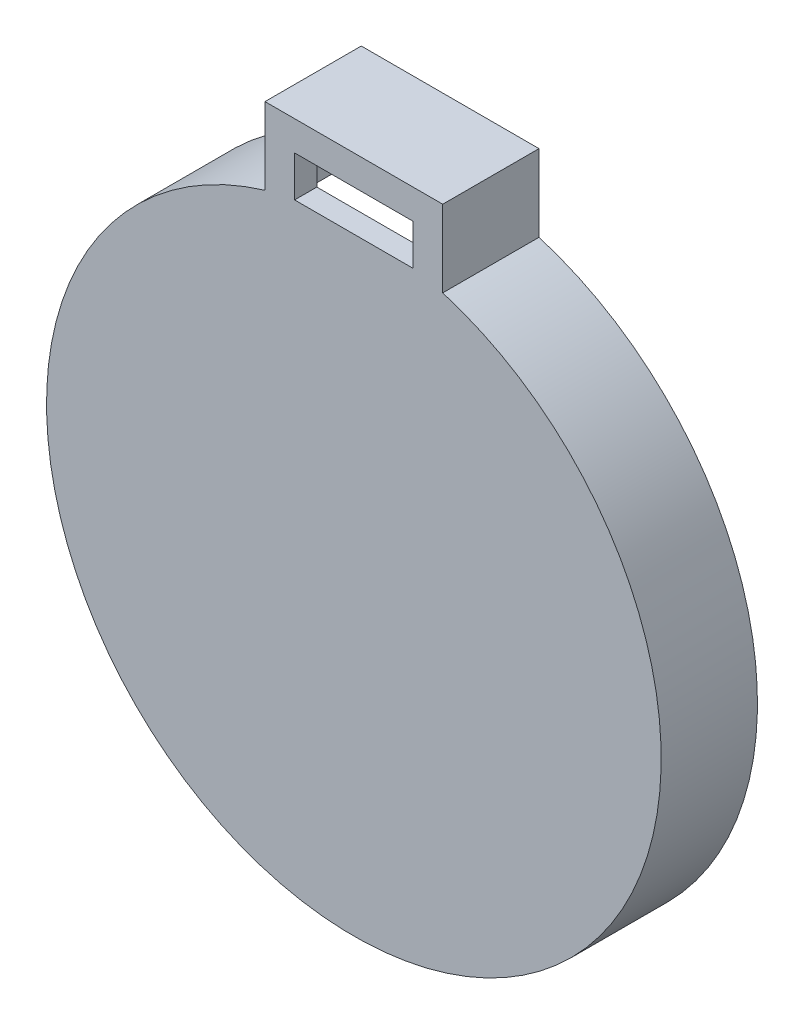
ISO-10303-21;
HEADER;
FILE_DESCRIPTION(('STEP AP214'),'2;1');
FILE_NAME('part.step','',(''),(''),'','','');
FILE_SCHEMA(('AUTOMOTIVE_DESIGN { 1 0 10303 214 1 1 1 1 }'));
ENDSEC;
DATA;
#1=APPLICATION_CONTEXT('core data for automotive mechanical design processes');
#2=APPLICATION_PROTOCOL_DEFINITION('international standard','automotive_design',2000,#1);
#3=PRODUCT_CONTEXT('',#1,'mechanical');
#4=PRODUCT('Part','Part','',(#3));
#5=PRODUCT_RELATED_PRODUCT_CATEGORY('part','',(#4));
#6=PRODUCT_DEFINITION_FORMATION('','',#4);
#7=PRODUCT_DEFINITION_CONTEXT('part definition',#1,'design');
#8=PRODUCT_DEFINITION('design','',#6,#7);
#9=PRODUCT_DEFINITION_SHAPE('','',#8);
#10=(LENGTH_UNIT() NAMED_UNIT(*) SI_UNIT(.MILLI.,.METRE.));
#11=(NAMED_UNIT(*) PLANE_ANGLE_UNIT() SI_UNIT($,.RADIAN.));
#12=(NAMED_UNIT(*) SI_UNIT($,.STERADIAN.) SOLID_ANGLE_UNIT());
#13=UNCERTAINTY_MEASURE_WITH_UNIT(LENGTH_MEASURE(1.E-05),#10,'distance_accuracy_value','');
#14=(GEOMETRIC_REPRESENTATION_CONTEXT(3) GLOBAL_UNCERTAINTY_ASSIGNED_CONTEXT((#13)) GLOBAL_UNIT_ASSIGNED_CONTEXT((#10,
#11,#12)) REPRESENTATION_CONTEXT('',''));
#15=CARTESIAN_POINT('',(0.,0.,0.));
#16=DIRECTION('',(0.,0.,1.));
#17=DIRECTION('',(1.,0.,0.));
#18=AXIS2_PLACEMENT_3D('',#15,#16,#17);
#19=CARTESIAN_POINT('',(0.,0.,-3.));
#20=DIRECTION('',(0.,0.,1.));
#21=DIRECTION('',(1.,0.,0.));
#22=AXIS2_PLACEMENT_3D('',#19,#20,#21);
#23=PLANE('',#22);
#24=DIRECTION('',(0.,-1.,0.));
#25=VECTOR('',#24,1.);
#26=CARTESIAN_POINT('',(-10.4999999999999,0.,-3.));
#27=LINE('',#26,#25);
#28=CARTESIAN_POINT('',(-10.5,48.5972796968906,-3.));
#29=VERTEX_POINT('',#28);
#30=CARTESIAN_POINT('',(-10.5,38.5972796968906,-3.));
#31=VERTEX_POINT('',#30);
#32=EDGE_CURVE('E163',#29,#31,#27,.T.);
#33=ORIENTED_EDGE('',*,*,#32,.F.);
#34=DIRECTION('',(1.,0.,0.));
#35=VECTOR('',#34,1.);
#36=CARTESIAN_POINT('',(0.,48.5972796968906,-3.));
#37=LINE('',#36,#35);
#38=CARTESIAN_POINT('',(10.5,48.5972796968906,-3.));
#39=VERTEX_POINT('',#38);
#40=EDGE_CURVE('E172',#29,#39,#37,.T.);
#41=ORIENTED_EDGE('',*,*,#40,.T.);
#42=DIRECTION('',(0.,-1.,0.));
#43=VECTOR('',#42,1.);
#44=CARTESIAN_POINT('',(10.5000000000001,0.,-3.));
#45=LINE('',#44,#43);
#46=CARTESIAN_POINT('',(10.5,38.5972796968906,-3.));
#47=VERTEX_POINT('',#46);
#48=EDGE_CURVE('E169',#39,#47,#45,.T.);
#49=ORIENTED_EDGE('',*,*,#48,.T.);
#50=CARTESIAN_POINT('',(0.,0.,-3.));
#51=DIRECTION('',(0.,0.,1.));
#52=DIRECTION('',(1.,0.,0.));
#53=AXIS2_PLACEMENT_3D('',#50,#51,#52);
#54=CIRCLE('',#53,40.);
#55=EDGE_CURVE('E166',#31,#47,#54,.T.);
#56=ORIENTED_EDGE('',*,*,#55,.F.);
#57=EDGE_LOOP('',(#33,#41,#49,#56));
#58=FACE_BOUND('',#57,.T.);
#59=DIRECTION('',(1.,0.,0.));
#60=VECTOR('',#59,1.);
#61=CARTESIAN_POINT('',(0.,46.0972796968903,-3.));
#62=LINE('',#61,#60);
#63=CARTESIAN_POINT('',(-8.,46.0972796968903,-3.));
#64=VERTEX_POINT('',#63);
#65=CARTESIAN_POINT('',(8.,46.0972796968903,-3.));
#66=VERTEX_POINT('',#65);
#67=EDGE_CURVE('E133',#64,#66,#62,.T.);
#68=ORIENTED_EDGE('',*,*,#67,.F.);
#69=DIRECTION('',(0.,-1.,0.));
#70=VECTOR('',#69,1.);
#71=CARTESIAN_POINT('',(-8.,0.,-3.));
#72=LINE('',#71,#70);
#73=CARTESIAN_POINT('',(-8.,40.5972796968903,-3.));
#74=VERTEX_POINT('',#73);
#75=EDGE_CURVE('E167',#64,#74,#72,.T.);
#76=ORIENTED_EDGE('',*,*,#75,.T.);
#77=DIRECTION('',(1.,0.,0.));
#78=VECTOR('',#77,1.);
#79=CARTESIAN_POINT('',(0.,40.5972796968903,-3.));
#80=LINE('',#79,#78);
#81=CARTESIAN_POINT('',(8.,40.5972796968903,-3.));
#82=VERTEX_POINT('',#81);
#83=EDGE_CURVE('E159',#74,#82,#80,.T.);
#84=ORIENTED_EDGE('',*,*,#83,.T.);
#85=DIRECTION('',(0.,-1.,0.));
#86=VECTOR('',#85,1.);
#87=CARTESIAN_POINT('',(8.,0.,-3.));
#88=LINE('',#87,#86);
#89=EDGE_CURVE('E162',#66,#82,#88,.T.);
#90=ORIENTED_EDGE('',*,*,#89,.F.);
#91=EDGE_LOOP('',(#68,#76,#84,#90));
#92=FACE_BOUND('',#91,.T.);
#93=ADVANCED_FACE('F40',(#58,#92),#23,.F.);
#94=CARTESIAN_POINT('',(0.,0.,0.));
#95=DIRECTION('',(0.,0.,1.));
#96=DIRECTION('',(1.,0.,0.));
#97=AXIS2_PLACEMENT_3D('',#94,#95,#96);
#98=PLANE('',#97);
#99=CARTESIAN_POINT('',(0.,0.,0.));
#100=DIRECTION('',(0.,0.,1.));
#101=DIRECTION('',(1.,0.,0.));
#102=AXIS2_PLACEMENT_3D('',#99,#100,#101);
#103=CIRCLE('',#102,41.5);
#104=CARTESIAN_POINT('',(-12.,39.7271947159625,0.));
#105=VERTEX_POINT('',#104);
#106=CARTESIAN_POINT('',(12.,39.7271947159625,0.));
#107=VERTEX_POINT('',#106);
#108=EDGE_CURVE('E175',#105,#107,#103,.T.);
#109=ORIENTED_EDGE('',*,*,#108,.T.);
#110=DIRECTION('',(0.,-1.,0.));
#111=VECTOR('',#110,1.);
#112=CARTESIAN_POINT('',(12.0000000000001,0.,0.));
#113=LINE('',#112,#111);
#114=CARTESIAN_POINT('',(12.,50.0972796968906,0.));
#115=VERTEX_POINT('',#114);
#116=EDGE_CURVE('E200',#115,#107,#113,.T.);
#117=ORIENTED_EDGE('',*,*,#116,.F.);
#118=DIRECTION('',(1.,0.,0.));
#119=VECTOR('',#118,1.);
#120=CARTESIAN_POINT('',(0.,50.0972796968906,0.));
#121=LINE('',#120,#119);
#122=CARTESIAN_POINT('',(-12.,50.0972796968906,0.));
#123=VERTEX_POINT('',#122);
#124=EDGE_CURVE('E203',#123,#115,#121,.T.);
#125=ORIENTED_EDGE('',*,*,#124,.F.);
#126=DIRECTION('',(0.,-1.,0.));
#127=VECTOR('',#126,1.);
#128=CARTESIAN_POINT('',(-11.9999999999999,0.,0.));
#129=LINE('',#128,#127);
#130=EDGE_CURVE('E180',#123,#105,#129,.T.);
#131=ORIENTED_EDGE('',*,*,#130,.T.);
#132=EDGE_LOOP('',(#109,#117,#125,#131));
#133=FACE_BOUND('',#132,.T.);
#134=DIRECTION('',(0.,1.,0.));
#135=VECTOR('',#134,1.);
#136=CARTESIAN_POINT('',(8.,0.,0.));
#137=LINE('',#136,#135);
#138=CARTESIAN_POINT('',(8.,40.5972796968903,0.));
#139=VERTEX_POINT('',#138);
#140=CARTESIAN_POINT('',(8.,46.0972796968903,0.));
#141=VERTEX_POINT('',#140);
#142=EDGE_CURVE('E140',#139,#141,#137,.T.);
#143=ORIENTED_EDGE('',*,*,#142,.F.);
#144=DIRECTION('',(-1.,0.,0.));
#145=VECTOR('',#144,1.);
#146=CARTESIAN_POINT('',(0.,40.5972796968903,0.));
#147=LINE('',#146,#145);
#148=CARTESIAN_POINT('',(-8.,40.5972796968903,0.));
#149=VERTEX_POINT('',#148);
#150=EDGE_CURVE('E146',#139,#149,#147,.T.);
#151=ORIENTED_EDGE('',*,*,#150,.T.);
#152=DIRECTION('',(0.,1.,0.));
#153=VECTOR('',#152,1.);
#154=CARTESIAN_POINT('',(-8.,0.,0.));
#155=LINE('',#154,#153);
#156=CARTESIAN_POINT('',(-8.,46.0972796968903,0.));
#157=VERTEX_POINT('',#156);
#158=EDGE_CURVE('E150',#149,#157,#155,.T.);
#159=ORIENTED_EDGE('',*,*,#158,.T.);
#160=DIRECTION('',(-1.,0.,0.));
#161=VECTOR('',#160,1.);
#162=CARTESIAN_POINT('',(0.,46.0972796968903,0.));
#163=LINE('',#162,#161);
#164=EDGE_CURVE('E65',#141,#157,#163,.T.);
#165=ORIENTED_EDGE('',*,*,#164,.F.);
#166=EDGE_LOOP('',(#143,#151,#159,#165));
#167=FACE_BOUND('',#166,.T.);
#168=ADVANCED_FACE('F149',(#133,#167),#98,.T.);
#169=CARTESIAN_POINT('',(10.5000000000001,0.,-13.));
#170=DIRECTION('',(-1.,0.,0.));
#171=DIRECTION('',(0.,-1.,0.));
#172=AXIS2_PLACEMENT_3D('',#169,#170,#171);
#173=PLANE('',#172);
#174=DIRECTION('',(0.,0.,1.));
#175=VECTOR('',#174,1.);
#176=CARTESIAN_POINT('',(10.5,38.5972796968906,-13.));
#177=LINE('',#176,#175);
#178=CARTESIAN_POINT('',(10.5,38.5972796968906,-13.));
#179=VERTEX_POINT('',#178);
#180=EDGE_CURVE('E44',#179,#47,#177,.T.);
#181=ORIENTED_EDGE('',*,*,#180,.T.);
#182=ORIENTED_EDGE('',*,*,#48,.F.);
#183=DIRECTION('',(0.,0.,1.));
#184=VECTOR('',#183,1.);
#185=CARTESIAN_POINT('',(10.5,48.5972796968906,-13.));
#186=LINE('',#185,#184);
#187=CARTESIAN_POINT('',(10.5,48.5972796968906,-13.));
#188=VERTEX_POINT('',#187);
#189=EDGE_CURVE('E214',#188,#39,#186,.T.);
#190=ORIENTED_EDGE('',*,*,#189,.F.);
#191=DIRECTION('',(0.,-1.,0.));
#192=VECTOR('',#191,1.);
#193=CARTESIAN_POINT('',(10.5000000000001,0.,-13.));
#194=LINE('',#193,#192);
#195=EDGE_CURVE('E176',#188,#179,#194,.T.);
#196=ORIENTED_EDGE('',*,*,#195,.T.);
#197=EDGE_LOOP('',(#181,#182,#190,#196));
#198=FACE_BOUND('',#197,.T.);
#199=ADVANCED_FACE('F42',(#198),#173,.T.);
#200=CARTESIAN_POINT('',(0.,48.5972796968906,-13.));
#201=DIRECTION('',(0.,-1.,0.));
#202=DIRECTION('',(0.,0.,-1.));
#203=AXIS2_PLACEMENT_3D('',#200,#201,#202);
#204=PLANE('',#203);
#205=ORIENTED_EDGE('',*,*,#189,.T.);
#206=ORIENTED_EDGE('',*,*,#40,.F.);
#207=DIRECTION('',(0.,0.,1.));
#208=VECTOR('',#207,1.);
#209=CARTESIAN_POINT('',(-10.5,48.5972796968906,-13.));
#210=LINE('',#209,#208);
#211=CARTESIAN_POINT('',(-10.5,48.5972796968906,-13.));
#212=VERTEX_POINT('',#211);
#213=EDGE_CURVE('E217',#212,#29,#210,.T.);
#214=ORIENTED_EDGE('',*,*,#213,.F.);
#215=DIRECTION('',(1.,0.,0.));
#216=VECTOR('',#215,1.);
#217=CARTESIAN_POINT('',(0.,48.5972796968906,-13.));
#218=LINE('',#217,#216);
#219=EDGE_CURVE('E184',#212,#188,#218,.T.);
#220=ORIENTED_EDGE('',*,*,#219,.T.);
#221=EDGE_LOOP('',(#205,#206,#214,#220));
#222=FACE_BOUND('',#221,.T.);
#223=ADVANCED_FACE('F232',(#222),#204,.T.);
#224=CARTESIAN_POINT('',(-10.4999999999999,0.,-13.));
#225=DIRECTION('',(-1.,0.,0.));
#226=DIRECTION('',(0.,-1.,0.));
#227=AXIS2_PLACEMENT_3D('',#224,#225,#226);
#228=PLANE('',#227);
#229=ORIENTED_EDGE('',*,*,#32,.T.);
#230=DIRECTION('',(0.,0.,1.));
#231=VECTOR('',#230,1.);
#232=CARTESIAN_POINT('',(-10.5,38.5972796968906,-13.));
#233=LINE('',#232,#231);
#234=CARTESIAN_POINT('',(-10.5,38.5972796968906,-13.));
#235=VERTEX_POINT('',#234);
#236=EDGE_CURVE('E219',#235,#31,#233,.T.);
#237=ORIENTED_EDGE('',*,*,#236,.F.);
#238=DIRECTION('',(0.,-1.,0.));
#239=VECTOR('',#238,1.);
#240=CARTESIAN_POINT('',(-10.4999999999999,0.,-13.));
#241=LINE('',#240,#239);
#242=EDGE_CURVE('E182',#212,#235,#241,.T.);
#243=ORIENTED_EDGE('',*,*,#242,.F.);
#244=ORIENTED_EDGE('',*,*,#213,.T.);
#245=EDGE_LOOP('',(#229,#237,#243,#244));
#246=FACE_BOUND('',#245,.T.);
#247=ADVANCED_FACE('F235',(#246),#228,.F.);
#248=CARTESIAN_POINT('',(0.,0.,-13.));
#249=DIRECTION('',(0.,0.,1.));
#250=DIRECTION('',(1.,0.,0.));
#251=AXIS2_PLACEMENT_3D('',#248,#249,#250);
#252=CYLINDRICAL_SURFACE('',#251,40.);
#253=ORIENTED_EDGE('',*,*,#55,.T.);
#254=ORIENTED_EDGE('',*,*,#180,.F.);
#255=CARTESIAN_POINT('',(0.,0.,-13.));
#256=DIRECTION('',(0.,0.,1.));
#257=DIRECTION('',(1.,0.,0.));
#258=AXIS2_PLACEMENT_3D('',#255,#256,#257);
#259=CIRCLE('',#258,40.);
#260=EDGE_CURVE('E179',#235,#179,#259,.T.);
#261=ORIENTED_EDGE('',*,*,#260,.F.);
#262=ORIENTED_EDGE('',*,*,#236,.T.);
#263=EDGE_LOOP('',(#253,#254,#261,#262));
#264=FACE_BOUND('',#263,.T.);
#265=ADVANCED_FACE('F240',(#264),#252,.F.);
#266=CARTESIAN_POINT('',(0.,0.,-13.));
#267=DIRECTION('',(0.,0.,1.));
#268=DIRECTION('',(1.,0.,0.));
#269=AXIS2_PLACEMENT_3D('',#266,#267,#268);
#270=CYLINDRICAL_SURFACE('',#269,41.5);
#271=ORIENTED_EDGE('',*,*,#108,.F.);
#272=DIRECTION('',(0.,0.,1.));
#273=VECTOR('',#272,1.);
#274=CARTESIAN_POINT('',(-12.,39.7271947159625,-13.));
#275=LINE('',#274,#273);
#276=CARTESIAN_POINT('',(-12.,39.7271947159625,-13.));
#277=VERTEX_POINT('',#276);
#278=EDGE_CURVE('E11',#277,#105,#275,.T.);
#279=ORIENTED_EDGE('',*,*,#278,.F.);
#280=CARTESIAN_POINT('',(0.,0.,-13.));
#281=DIRECTION('',(0.,0.,1.));
#282=DIRECTION('',(1.,0.,0.));
#283=AXIS2_PLACEMENT_3D('',#280,#281,#282);
#284=CIRCLE('',#283,41.5);
#285=CARTESIAN_POINT('',(12.,39.7271947159625,-13.));
#286=VERTEX_POINT('',#285);
#287=EDGE_CURVE('E187',#277,#286,#284,.T.);
#288=ORIENTED_EDGE('',*,*,#287,.T.);
#289=DIRECTION('',(0.,0.,1.));
#290=VECTOR('',#289,1.);
#291=CARTESIAN_POINT('',(12.,39.7271947159625,-13.));
#292=LINE('',#291,#290);
#293=EDGE_CURVE('E212',#286,#107,#292,.T.);
#294=ORIENTED_EDGE('',*,*,#293,.T.);
#295=EDGE_LOOP('',(#271,#279,#288,#294));
#296=FACE_BOUND('',#295,.T.);
#297=ADVANCED_FACE('F242',(#296),#270,.T.);
#298=CARTESIAN_POINT('',(-11.9999999999999,0.,-13.));
#299=DIRECTION('',(-1.,0.,0.));
#300=DIRECTION('',(0.,-1.,0.));
#301=AXIS2_PLACEMENT_3D('',#298,#299,#300);
#302=PLANE('',#301);
#303=ORIENTED_EDGE('',*,*,#130,.F.);
#304=DIRECTION('',(0.,0.,1.));
#305=VECTOR('',#304,1.);
#306=CARTESIAN_POINT('',(-12.,50.0972796968906,-13.));
#307=LINE('',#306,#305);
#308=CARTESIAN_POINT('',(-12.,50.0972796968906,-13.));
#309=VERTEX_POINT('',#308);
#310=EDGE_CURVE('E49',#309,#123,#307,.T.);
#311=ORIENTED_EDGE('',*,*,#310,.F.);
#312=DIRECTION('',(0.,-1.,0.));
#313=VECTOR('',#312,1.);
#314=CARTESIAN_POINT('',(-11.9999999999999,0.,-13.));
#315=LINE('',#314,#313);
#316=EDGE_CURVE('E195',#309,#277,#315,.T.);
#317=ORIENTED_EDGE('',*,*,#316,.T.);
#318=ORIENTED_EDGE('',*,*,#278,.T.);
#319=EDGE_LOOP('',(#303,#311,#317,#318));
#320=FACE_BOUND('',#319,.T.);
#321=ADVANCED_FACE('F247',(#320),#302,.T.);
#322=CARTESIAN_POINT('',(0.,50.0972796968906,-13.));
#323=DIRECTION('',(0.,-1.,0.));
#324=DIRECTION('',(0.,0.,-1.));
#325=AXIS2_PLACEMENT_3D('',#322,#323,#324);
#326=PLANE('',#325);
#327=ORIENTED_EDGE('',*,*,#124,.T.);
#328=DIRECTION('',(0.,0.,1.));
#329=VECTOR('',#328,1.);
#330=CARTESIAN_POINT('',(12.,50.0972796968906,-13.));
#331=LINE('',#330,#329);
#332=CARTESIAN_POINT('',(12.,50.0972796968906,-13.));
#333=VERTEX_POINT('',#332);
#334=EDGE_CURVE('E209',#333,#115,#331,.T.);
#335=ORIENTED_EDGE('',*,*,#334,.F.);
#336=DIRECTION('',(1.,0.,0.));
#337=VECTOR('',#336,1.);
#338=CARTESIAN_POINT('',(0.,50.0972796968906,-13.));
#339=LINE('',#338,#337);
#340=EDGE_CURVE('E192',#309,#333,#339,.T.);
#341=ORIENTED_EDGE('',*,*,#340,.F.);
#342=ORIENTED_EDGE('',*,*,#310,.T.);
#343=EDGE_LOOP('',(#327,#335,#341,#342));
#344=FACE_BOUND('',#343,.T.);
#345=ADVANCED_FACE('F268',(#344),#326,.F.);
#346=CARTESIAN_POINT('',(12.0000000000001,0.,-13.));
#347=DIRECTION('',(-1.,0.,0.));
#348=DIRECTION('',(0.,-1.,0.));
#349=AXIS2_PLACEMENT_3D('',#346,#347,#348);
#350=PLANE('',#349);
#351=ORIENTED_EDGE('',*,*,#116,.T.);
#352=ORIENTED_EDGE('',*,*,#293,.F.);
#353=DIRECTION('',(0.,-1.,0.));
#354=VECTOR('',#353,1.);
#355=CARTESIAN_POINT('',(12.0000000000001,0.,-13.));
#356=LINE('',#355,#354);
#357=EDGE_CURVE('E190',#333,#286,#356,.T.);
#358=ORIENTED_EDGE('',*,*,#357,.F.);
#359=ORIENTED_EDGE('',*,*,#334,.T.);
#360=EDGE_LOOP('',(#351,#352,#358,#359));
#361=FACE_BOUND('',#360,.T.);
#362=ADVANCED_FACE('F264',(#361),#350,.F.);
#363=CARTESIAN_POINT('',(0.,0.,-13.));
#364=DIRECTION('',(0.,0.,1.));
#365=DIRECTION('',(1.,0.,0.));
#366=AXIS2_PLACEMENT_3D('',#363,#364,#365);
#367=PLANE('',#366);
#368=ORIENTED_EDGE('',*,*,#195,.F.);
#369=ORIENTED_EDGE('',*,*,#219,.F.);
#370=ORIENTED_EDGE('',*,*,#242,.T.);
#371=ORIENTED_EDGE('',*,*,#260,.T.);
#372=EDGE_LOOP('',(#368,#369,#370,#371));
#373=FACE_BOUND('',#372,.T.);
#374=ORIENTED_EDGE('',*,*,#287,.F.);
#375=ORIENTED_EDGE('',*,*,#316,.F.);
#376=ORIENTED_EDGE('',*,*,#340,.T.);
#377=ORIENTED_EDGE('',*,*,#357,.T.);
#378=EDGE_LOOP('',(#374,#375,#376,#377));
#379=FACE_BOUND('',#378,.T.);
#380=ADVANCED_FACE('F238',(#373,#379),#367,.F.);
#381=CARTESIAN_POINT('',(0.,40.5972796968903,-19.9189243156886));
#382=DIRECTION('',(0.,1.,0.));
#383=DIRECTION('',(0.,0.,1.));
#384=AXIS2_PLACEMENT_3D('',#381,#382,#383);
#385=PLANE('',#384);
#386=DIRECTION('',(0.,0.,1.));
#387=VECTOR('',#386,1.);
#388=CARTESIAN_POINT('',(-8.,40.5972796968903,-19.9189243156886));
#389=LINE('',#388,#387);
#390=EDGE_CURVE('E57',#74,#149,#389,.T.);
#391=ORIENTED_EDGE('',*,*,#390,.T.);
#392=ORIENTED_EDGE('',*,*,#150,.F.);
#393=DIRECTION('',(0.,0.,1.));
#394=VECTOR('',#393,1.);
#395=CARTESIAN_POINT('',(8.,40.5972796968903,-19.9189243156886));
#396=LINE('',#395,#394);
#397=EDGE_CURVE('E137',#82,#139,#396,.T.);
#398=ORIENTED_EDGE('',*,*,#397,.F.);
#399=ORIENTED_EDGE('',*,*,#83,.F.);
#400=EDGE_LOOP('',(#391,#392,#398,#399));
#401=FACE_BOUND('',#400,.T.);
#402=ADVANCED_FACE('F263',(#401),#385,.T.);
#403=CARTESIAN_POINT('',(8.,0.,-19.9189243156886));
#404=DIRECTION('',(1.,0.,0.));
#405=DIRECTION('',(0.,0.,-1.));
#406=AXIS2_PLACEMENT_3D('',#403,#404,#405);
#407=PLANE('',#406);
#408=ORIENTED_EDGE('',*,*,#89,.T.);
#409=ORIENTED_EDGE('',*,*,#397,.T.);
#410=ORIENTED_EDGE('',*,*,#142,.T.);
#411=DIRECTION('',(0.,0.,1.));
#412=VECTOR('',#411,1.);
#413=CARTESIAN_POINT('',(8.,46.0972796968903,-19.9189243156886));
#414=LINE('',#413,#412);
#415=EDGE_CURVE('E129',#66,#141,#414,.T.);
#416=ORIENTED_EDGE('',*,*,#415,.F.);
#417=EDGE_LOOP('',(#408,#409,#410,#416));
#418=FACE_BOUND('',#417,.T.);
#419=ADVANCED_FACE('F141',(#418),#407,.F.);
#420=CARTESIAN_POINT('',(0.,46.0972796968903,-19.9189243156886));
#421=DIRECTION('',(0.,1.,0.));
#422=DIRECTION('',(-1.,0.,0.));
#423=AXIS2_PLACEMENT_3D('',#420,#421,#422);
#424=PLANE('',#423);
#425=ORIENTED_EDGE('',*,*,#67,.T.);
#426=ORIENTED_EDGE('',*,*,#415,.T.);
#427=ORIENTED_EDGE('',*,*,#164,.T.);
#428=DIRECTION('',(0.,0.,1.));
#429=VECTOR('',#428,1.);
#430=CARTESIAN_POINT('',(-8.,46.0972796968903,-19.9189243156886));
#431=LINE('',#430,#429);
#432=EDGE_CURVE('E136',#64,#157,#431,.T.);
#433=ORIENTED_EDGE('',*,*,#432,.F.);
#434=EDGE_LOOP('',(#425,#426,#427,#433));
#435=FACE_BOUND('',#434,.T.);
#436=ADVANCED_FACE('F131',(#435),#424,.F.);
#437=CARTESIAN_POINT('',(-8.,0.,-19.9189243156886));
#438=DIRECTION('',(1.,0.,0.));
#439=DIRECTION('',(0.,0.,-1.));
#440=AXIS2_PLACEMENT_3D('',#437,#438,#439);
#441=PLANE('',#440);
#442=ORIENTED_EDGE('',*,*,#432,.T.);
#443=ORIENTED_EDGE('',*,*,#158,.F.);
#444=ORIENTED_EDGE('',*,*,#390,.F.);
#445=ORIENTED_EDGE('',*,*,#75,.F.);
#446=EDGE_LOOP('',(#442,#443,#444,#445));
#447=FACE_BOUND('',#446,.T.);
#448=ADVANCED_FACE('F260',(#447),#441,.T.);
#449=CLOSED_SHELL('',(#93,#168,#199,#223,#247,#265,#297,#321,#345,#362,#380,#402,#419,#436,#448));
#450=MANIFOLD_SOLID_BREP('B2',#449);
#451=ADVANCED_BREP_SHAPE_REPRESENTATION('',(#18,#450),#14);
#452=SHAPE_DEFINITION_REPRESENTATION(#9,#451);
ENDSEC;
END-ISO-10303-21;
